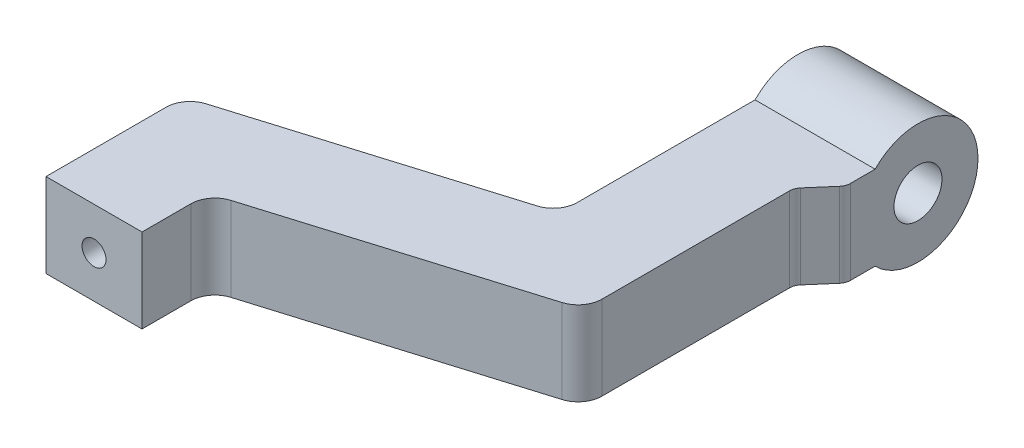
ISO-10303-21;
HEADER;
FILE_DESCRIPTION(('STEP AP214'),'2;1');
FILE_NAME('part.step','',(''),(''),'','','');
FILE_SCHEMA(('AUTOMOTIVE_DESIGN { 1 0 10303 214 1 1 1 1 }'));
ENDSEC;
DATA;
#1=APPLICATION_CONTEXT('core data for automotive mechanical design processes');
#2=APPLICATION_PROTOCOL_DEFINITION('international standard','automotive_design',2000,#1);
#3=PRODUCT_CONTEXT('',#1,'mechanical');
#4=PRODUCT('Part','Part','',(#3));
#5=PRODUCT_RELATED_PRODUCT_CATEGORY('part','',(#4));
#6=PRODUCT_DEFINITION_FORMATION('','',#4);
#7=PRODUCT_DEFINITION_CONTEXT('part definition',#1,'design');
#8=PRODUCT_DEFINITION('design','',#6,#7);
#9=PRODUCT_DEFINITION_SHAPE('','',#8);
#10=(LENGTH_UNIT() NAMED_UNIT(*) SI_UNIT(.MILLI.,.METRE.));
#11=(NAMED_UNIT(*) PLANE_ANGLE_UNIT() SI_UNIT($,.RADIAN.));
#12=(NAMED_UNIT(*) SI_UNIT($,.STERADIAN.) SOLID_ANGLE_UNIT());
#13=UNCERTAINTY_MEASURE_WITH_UNIT(LENGTH_MEASURE(1.E-05),#10,'distance_accuracy_value','');
#14=(GEOMETRIC_REPRESENTATION_CONTEXT(3) GLOBAL_UNCERTAINTY_ASSIGNED_CONTEXT((#13)) GLOBAL_UNIT_ASSIGNED_CONTEXT((#10,
#11,#12)) REPRESENTATION_CONTEXT('',''));
#15=CARTESIAN_POINT('',(0.,0.,0.));
#16=DIRECTION('',(0.,0.,1.));
#17=DIRECTION('',(1.,0.,0.));
#18=AXIS2_PLACEMENT_3D('',#15,#16,#17);
#19=CARTESIAN_POINT('',(9.49933731581298,3.5,-22.2534961346693));
#20=DIRECTION('',(0.,-1.,0.));
#21=DIRECTION('',(0.,0.,-1.));
#22=AXIS2_PLACEMENT_3D('',#19,#20,#21);
#23=CYLINDRICAL_SURFACE('',#22,0.999999999999999);
#24=CARTESIAN_POINT('',(9.49933731581298,0.,-22.2534961346693));
#25=DIRECTION('',(0.,1.,0.));
#26=DIRECTION('',(0.,0.,1.));
#27=AXIS2_PLACEMENT_3D('',#24,#25,#26);
#28=CIRCLE('',#27,0.999999999999999);
#29=CARTESIAN_POINT('',(9.78975935606598,0.,-21.2965974783136));
#30=VERTEX_POINT('',#29);
#31=CARTESIAN_POINT('',(10.499337315813,0.,-22.2534961346693));
#32=VERTEX_POINT('',#31);
#33=EDGE_CURVE('E157',#30,#32,#28,.T.);
#34=ORIENTED_EDGE('',*,*,#33,.F.);
#35=DIRECTION('',(0.,-1.,0.));
#36=VECTOR('',#35,1.);
#37=CARTESIAN_POINT('',(9.78975935606598,3.5,-21.2965974783136));
#38=LINE('',#37,#36);
#39=CARTESIAN_POINT('',(9.78975935606598,3.5,-21.2965974783136));
#40=VERTEX_POINT('',#39);
#41=EDGE_CURVE('E152',#40,#30,#38,.T.);
#42=ORIENTED_EDGE('',*,*,#41,.F.);
#43=CARTESIAN_POINT('',(9.49933731581298,3.5,-22.2534961346693));
#44=DIRECTION('',(0.,1.,0.));
#45=DIRECTION('',(0.,0.,1.));
#46=AXIS2_PLACEMENT_3D('',#43,#44,#45);
#47=CIRCLE('',#46,0.999999999999999);
#48=CARTESIAN_POINT('',(10.499337315813,3.5,-22.2534961346693));
#49=VERTEX_POINT('',#48);
#50=EDGE_CURVE('E154',#40,#49,#47,.T.);
#51=ORIENTED_EDGE('',*,*,#50,.T.);
#52=DIRECTION('',(0.,-1.,0.));
#53=VECTOR('',#52,1.);
#54=CARTESIAN_POINT('',(10.499337315813,3.5,-22.2534961346693));
#55=LINE('',#54,#53);
#56=EDGE_CURVE('E203',#49,#32,#55,.T.);
#57=ORIENTED_EDGE('',*,*,#56,.T.);
#58=EDGE_LOOP('',(#34,#42,#51,#57));
#59=FACE_BOUND('',#58,.T.);
#60=ADVANCED_FACE('F38',(#59),#23,.F.);
#61=CARTESIAN_POINT('',(-5.09270254841744,3.5,-16.7797189963762));
#62=DIRECTION('',(-0.290422040253007,0.,-0.956898656355667));
#63=DIRECTION('',(-0.956898656355667,0.,0.290422040253007));
#64=AXIS2_PLACEMENT_3D('',#61,#62,#63);
#65=PLANE('',#64);
#66=DIRECTION('',(0.956898656355667,0.,-0.290422040253007));
#67=VECTOR('',#66,1.);
#68=CARTESIAN_POINT('',(-5.09270254841744,0.,-16.7797189963762));
#69=LINE('',#68,#67);
#70=CARTESIAN_POINT('',(-0.79108472444003,0.,-18.085274831919));
#71=VERTEX_POINT('',#70);
#72=EDGE_CURVE('E205',#71,#30,#69,.T.);
#73=ORIENTED_EDGE('',*,*,#72,.F.);
#74=DIRECTION('',(0.,-1.,0.));
#75=VECTOR('',#74,1.);
#76=CARTESIAN_POINT('',(-0.79108472444003,3.5,-18.085274831919));
#77=LINE('',#76,#75);
#78=CARTESIAN_POINT('',(-0.79108472444003,3.5,-18.085274831919));
#79=VERTEX_POINT('',#78);
#80=EDGE_CURVE('E163',#79,#71,#77,.T.);
#81=ORIENTED_EDGE('',*,*,#80,.F.);
#82=DIRECTION('',(0.956898656355667,0.,-0.290422040253007));
#83=VECTOR('',#82,1.);
#84=CARTESIAN_POINT('',(-5.09270254841744,3.5,-16.7797189963762));
#85=LINE('',#84,#83);
#86=EDGE_CURVE('E168',#79,#40,#85,.T.);
#87=ORIENTED_EDGE('',*,*,#86,.T.);
#88=ORIENTED_EDGE('',*,*,#41,.T.);
#89=EDGE_LOOP('',(#73,#81,#87,#88));
#90=FACE_BOUND('',#89,.T.);
#91=ADVANCED_FACE('F174',(#90),#65,.T.);
#92=CARTESIAN_POINT('',(-0.500662684187023,3.5,-17.1283761755634));
#93=DIRECTION('',(0.,-1.,0.));
#94=DIRECTION('',(0.,0.,-1.));
#95=AXIS2_PLACEMENT_3D('',#92,#93,#94);
#96=CYLINDRICAL_SURFACE('',#95,0.999999999999999);
#97=CARTESIAN_POINT('',(-0.500662684187023,0.,-17.1283761755634));
#98=DIRECTION('',(0.,1.,0.));
#99=DIRECTION('',(0.,0.,1.));
#100=AXIS2_PLACEMENT_3D('',#97,#98,#99);
#101=CIRCLE('',#100,0.999999999999999);
#102=CARTESIAN_POINT('',(-1.50066268418702,0.,-17.1283761755634));
#103=VERTEX_POINT('',#102);
#104=EDGE_CURVE('E208',#103,#71,#101,.F.);
#105=ORIENTED_EDGE('',*,*,#104,.F.);
#106=DIRECTION('',(0.,-1.,0.));
#107=VECTOR('',#106,1.);
#108=CARTESIAN_POINT('',(-1.50066268418702,3.5,-17.1283761755634));
#109=LINE('',#108,#107);
#110=CARTESIAN_POINT('',(-1.50066268418702,3.5,-17.1283761755634));
#111=VERTEX_POINT('',#110);
#112=EDGE_CURVE('E252',#111,#103,#109,.T.);
#113=ORIENTED_EDGE('',*,*,#112,.F.);
#114=CARTESIAN_POINT('',(-0.500662684187023,3.5,-17.1283761755634));
#115=DIRECTION('',(0.,1.,0.));
#116=DIRECTION('',(0.,0.,1.));
#117=AXIS2_PLACEMENT_3D('',#114,#115,#116);
#118=CIRCLE('',#117,0.999999999999999);
#119=EDGE_CURVE('E175',#111,#79,#118,.F.);
#120=ORIENTED_EDGE('',*,*,#119,.T.);
#121=ORIENTED_EDGE('',*,*,#80,.T.);
#122=EDGE_LOOP('',(#105,#113,#120,#121));
#123=FACE_BOUND('',#122,.T.);
#124=ADVANCED_FACE('F336',(#123),#96,.T.);
#125=CARTESIAN_POINT('',(-1.50066268418702,3.5,0.));
#126=DIRECTION('',(-1.,0.,0.));
#127=DIRECTION('',(0.,0.,1.));
#128=AXIS2_PLACEMENT_3D('',#125,#126,#127);
#129=PLANE('',#128);
#130=DIRECTION('',(0.,0.,-1.));
#131=VECTOR('',#130,1.);
#132=CARTESIAN_POINT('',(-1.50066268418702,0.,0.));
#133=LINE('',#132,#131);
#134=CARTESIAN_POINT('',(-1.50066268418702,0.,-12.1283761755634));
#135=VERTEX_POINT('',#134);
#136=EDGE_CURVE('E211',#135,#103,#133,.T.);
#137=ORIENTED_EDGE('',*,*,#136,.F.);
#138=DIRECTION('',(0.,-1.,0.));
#139=VECTOR('',#138,1.);
#140=CARTESIAN_POINT('',(-1.50066268418702,3.5,-12.1283761755634));
#141=LINE('',#140,#139);
#142=CARTESIAN_POINT('',(-1.50066268418702,3.5,-12.1283761755634));
#143=VERTEX_POINT('',#142);
#144=EDGE_CURVE('E250',#143,#135,#141,.T.);
#145=ORIENTED_EDGE('',*,*,#144,.F.);
#146=DIRECTION('',(0.,0.,-1.));
#147=VECTOR('',#146,1.);
#148=CARTESIAN_POINT('',(-1.50066268418702,3.5,0.));
#149=LINE('',#148,#147);
#150=EDGE_CURVE('E177',#143,#111,#149,.T.);
#151=ORIENTED_EDGE('',*,*,#150,.T.);
#152=ORIENTED_EDGE('',*,*,#112,.T.);
#153=EDGE_LOOP('',(#137,#145,#151,#152));
#154=FACE_BOUND('',#153,.T.);
#155=ADVANCED_FACE('F365',(#154),#129,.T.);
#156=CARTESIAN_POINT('',(0.,3.5,-12.1283761755634));
#157=DIRECTION('',(0.,0.,-1.));
#158=DIRECTION('',(-1.,0.,0.));
#159=AXIS2_PLACEMENT_3D('',#156,#157,#158);
#160=PLANE('',#159);
#161=CARTESIAN_POINT('',(0.499337315812977,1.75,-12.1283761755634));
#162=DIRECTION('',(0.,0.,1.));
#163=DIRECTION('',(1.,0.,0.));
#164=AXIS2_PLACEMENT_3D('',#161,#162,#163);
#165=CIRCLE('',#164,0.5);
#166=CARTESIAN_POINT('',(0.999337315812977,1.75,-12.1283761755634));
#167=VERTEX_POINT('',#166);
#168=EDGE_CURVE('E302',#167,#167,#165,.T.);
#169=ORIENTED_EDGE('',*,*,#168,.F.);
#170=EDGE_LOOP('',(#169));
#171=FACE_BOUND('',#170,.T.);
#172=DIRECTION('',(1.,0.,0.));
#173=VECTOR('',#172,1.);
#174=CARTESIAN_POINT('',(0.,0.,-12.1283761755634));
#175=LINE('',#174,#173);
#176=CARTESIAN_POINT('',(2.49933731581298,0.,-12.1283761755634));
#177=VERTEX_POINT('',#176);
#178=EDGE_CURVE('E214',#135,#177,#175,.T.);
#179=ORIENTED_EDGE('',*,*,#178,.T.);
#180=DIRECTION('',(0.,-1.,0.));
#181=VECTOR('',#180,1.);
#182=CARTESIAN_POINT('',(2.49933731581298,3.5,-12.1283761755634));
#183=LINE('',#182,#181);
#184=CARTESIAN_POINT('',(2.49933731581298,3.5,-12.1283761755634));
#185=VERTEX_POINT('',#184);
#186=EDGE_CURVE('E247',#185,#177,#183,.T.);
#187=ORIENTED_EDGE('',*,*,#186,.F.);
#188=DIRECTION('',(1.,0.,0.));
#189=VECTOR('',#188,1.);
#190=CARTESIAN_POINT('',(0.,3.5,-12.1283761755634));
#191=LINE('',#190,#189);
#192=EDGE_CURVE('E183',#143,#185,#191,.T.);
#193=ORIENTED_EDGE('',*,*,#192,.F.);
#194=ORIENTED_EDGE('',*,*,#144,.T.);
#195=EDGE_LOOP('',(#179,#187,#193,#194));
#196=FACE_BOUND('',#195,.T.);
#197=ADVANCED_FACE('F361',(#171,#196),#160,.F.);
#198=CARTESIAN_POINT('',(2.49933731581298,3.5,0.));
#199=DIRECTION('',(-1.,0.,0.));
#200=DIRECTION('',(0.,0.,1.));
#201=AXIS2_PLACEMENT_3D('',#198,#199,#200);
#202=PLANE('',#201);
#203=DIRECTION('',(0.,0.,-1.));
#204=VECTOR('',#203,1.);
#205=CARTESIAN_POINT('',(2.49933731581298,0.,0.));
#206=LINE('',#205,#204);
#207=CARTESIAN_POINT('',(2.49933731581298,0.,-14.1622189758055));
#208=VERTEX_POINT('',#207);
#209=EDGE_CURVE('E216',#177,#208,#206,.T.);
#210=ORIENTED_EDGE('',*,*,#209,.T.);
#211=DIRECTION('',(0.,-1.,0.));
#212=VECTOR('',#211,1.);
#213=CARTESIAN_POINT('',(2.49933731581298,3.5,-14.1622189758055));
#214=LINE('',#213,#212);
#215=CARTESIAN_POINT('',(2.49933731581298,3.5,-14.1622189758055));
#216=VERTEX_POINT('',#215);
#217=EDGE_CURVE('E245',#216,#208,#214,.T.);
#218=ORIENTED_EDGE('',*,*,#217,.F.);
#219=DIRECTION('',(0.,0.,-1.));
#220=VECTOR('',#219,1.);
#221=CARTESIAN_POINT('',(2.49933731581298,3.5,0.));
#222=LINE('',#221,#220);
#223=EDGE_CURVE('E185',#185,#216,#222,.T.);
#224=ORIENTED_EDGE('',*,*,#223,.F.);
#225=ORIENTED_EDGE('',*,*,#186,.T.);
#226=EDGE_LOOP('',(#210,#218,#224,#225));
#227=FACE_BOUND('',#226,.T.);
#228=ADVANCED_FACE('F364',(#227),#202,.F.);
#229=CARTESIAN_POINT('',(3.49933731581298,3.5,-14.1622189758055));
#230=DIRECTION('',(0.,-1.,0.));
#231=DIRECTION('',(0.,0.,-1.));
#232=AXIS2_PLACEMENT_3D('',#229,#230,#231);
#233=CYLINDRICAL_SURFACE('',#232,0.999999999999999);
#234=CARTESIAN_POINT('',(3.49933731581298,0.,-14.1622189758055));
#235=DIRECTION('',(0.,1.,0.));
#236=DIRECTION('',(0.,0.,1.));
#237=AXIS2_PLACEMENT_3D('',#234,#235,#236);
#238=CIRCLE('',#237,0.999999999999999);
#239=CARTESIAN_POINT('',(3.20891527555997,0.,-15.1191176321612));
#240=VERTEX_POINT('',#239);
#241=EDGE_CURVE('E219',#240,#208,#238,.T.);
#242=ORIENTED_EDGE('',*,*,#241,.F.);
#243=DIRECTION('',(0.,-1.,0.));
#244=VECTOR('',#243,1.);
#245=CARTESIAN_POINT('',(3.20891527555997,3.5,-15.1191176321612));
#246=LINE('',#245,#244);
#247=CARTESIAN_POINT('',(3.20891527555997,3.5,-15.1191176321612));
#248=VERTEX_POINT('',#247);
#249=EDGE_CURVE('E243',#248,#240,#246,.T.);
#250=ORIENTED_EDGE('',*,*,#249,.F.);
#251=CARTESIAN_POINT('',(3.49933731581298,3.5,-14.1622189758055));
#252=DIRECTION('',(0.,1.,0.));
#253=DIRECTION('',(0.,0.,1.));
#254=AXIS2_PLACEMENT_3D('',#251,#252,#253);
#255=CIRCLE('',#254,0.999999999999999);
#256=EDGE_CURVE('E187',#248,#216,#255,.T.);
#257=ORIENTED_EDGE('',*,*,#256,.T.);
#258=ORIENTED_EDGE('',*,*,#217,.T.);
#259=EDGE_LOOP('',(#242,#250,#257,#258));
#260=FACE_BOUND('',#259,.T.);
#261=ADVANCED_FACE('F378',(#260),#233,.F.);
#262=CARTESIAN_POINT('',(-3.93101438740541,3.5,-12.9521243709536));
#263=DIRECTION('',(-0.290422040253007,0.,-0.956898656355667));
#264=DIRECTION('',(-0.956898656355667,0.,0.290422040253007));
#265=AXIS2_PLACEMENT_3D('',#262,#263,#264);
#266=PLANE('',#265);
#267=DIRECTION('',(0.956898656355667,0.,-0.290422040253007));
#268=VECTOR('',#267,1.);
#269=CARTESIAN_POINT('',(-3.93101438740541,0.,-12.9521243709536));
#270=LINE('',#269,#268);
#271=CARTESIAN_POINT('',(13.789759356066,0.,-18.3304402785558));
#272=VERTEX_POINT('',#271);
#273=EDGE_CURVE('E222',#240,#272,#270,.T.);
#274=ORIENTED_EDGE('',*,*,#273,.T.);
#275=DIRECTION('',(0.,-1.,0.));
#276=VECTOR('',#275,1.);
#277=CARTESIAN_POINT('',(13.789759356066,3.5,-18.3304402785558));
#278=LINE('',#277,#276);
#279=CARTESIAN_POINT('',(13.789759356066,3.5,-18.3304402785558));
#280=VERTEX_POINT('',#279);
#281=EDGE_CURVE('E240',#280,#272,#278,.T.);
#282=ORIENTED_EDGE('',*,*,#281,.F.);
#283=DIRECTION('',(0.956898656355667,0.,-0.290422040253007));
#284=VECTOR('',#283,1.);
#285=CARTESIAN_POINT('',(-3.93101438740541,3.5,-12.9521243709536));
#286=LINE('',#285,#284);
#287=EDGE_CURVE('E190',#248,#280,#286,.T.);
#288=ORIENTED_EDGE('',*,*,#287,.F.);
#289=ORIENTED_EDGE('',*,*,#249,.T.);
#290=EDGE_LOOP('',(#274,#282,#288,#289));
#291=FACE_BOUND('',#290,.T.);
#292=ADVANCED_FACE('F396',(#291),#266,.F.);
#293=CARTESIAN_POINT('',(13.499337315813,3.5,-19.2873389349115));
#294=DIRECTION('',(0.,-1.,0.));
#295=DIRECTION('',(0.,0.,-1.));
#296=AXIS2_PLACEMENT_3D('',#293,#294,#295);
#297=CYLINDRICAL_SURFACE('',#296,1.);
#298=CARTESIAN_POINT('',(13.499337315813,0.,-19.2873389349115));
#299=DIRECTION('',(0.,1.,0.));
#300=DIRECTION('',(0.,0.,1.));
#301=AXIS2_PLACEMENT_3D('',#298,#299,#300);
#302=CIRCLE('',#301,1.);
#303=CARTESIAN_POINT('',(14.499337315813,0.,-19.2873389349115));
#304=VERTEX_POINT('',#303);
#305=EDGE_CURVE('E224',#272,#304,#302,.T.);
#306=ORIENTED_EDGE('',*,*,#305,.T.);
#307=DIRECTION('',(0.,-1.,0.));
#308=VECTOR('',#307,1.);
#309=CARTESIAN_POINT('',(14.499337315813,3.5,-19.2873389349115));
#310=LINE('',#309,#308);
#311=CARTESIAN_POINT('',(14.499337315813,3.5,-19.2873389349115));
#312=VERTEX_POINT('',#311);
#313=EDGE_CURVE('E237',#312,#304,#310,.T.);
#314=ORIENTED_EDGE('',*,*,#313,.F.);
#315=CARTESIAN_POINT('',(13.499337315813,3.5,-19.2873389349115));
#316=DIRECTION('',(0.,1.,0.));
#317=DIRECTION('',(0.,0.,1.));
#318=AXIS2_PLACEMENT_3D('',#315,#316,#317);
#319=CIRCLE('',#318,1.);
#320=EDGE_CURVE('E192',#280,#312,#319,.T.);
#321=ORIENTED_EDGE('',*,*,#320,.F.);
#322=ORIENTED_EDGE('',*,*,#281,.T.);
#323=EDGE_LOOP('',(#306,#314,#321,#322));
#324=FACE_BOUND('',#323,.T.);
#325=ADVANCED_FACE('F399',(#324),#297,.T.);
#326=CARTESIAN_POINT('',(14.499337315813,3.5,0.));
#327=DIRECTION('',(-1.,0.,0.));
#328=DIRECTION('',(0.,0.,1.));
#329=AXIS2_PLACEMENT_3D('',#326,#327,#328);
#330=PLANE('',#329);
#331=DIRECTION('',(0.,0.,-1.));
#332=VECTOR('',#331,1.);
#333=CARTESIAN_POINT('',(14.499337315813,0.,0.));
#334=LINE('',#333,#332);
#335=CARTESIAN_POINT('',(14.499337315813,0.,-27.1012312673421));
#336=VERTEX_POINT('',#335);
#337=EDGE_CURVE('E226',#304,#336,#334,.T.);
#338=ORIENTED_EDGE('',*,*,#337,.T.);
#339=DIRECTION('',(0.,-1.,0.));
#340=VECTOR('',#339,1.);
#341=CARTESIAN_POINT('',(14.499337315813,3.5,-27.1012312673421));
#342=LINE('',#341,#340);
#343=CARTESIAN_POINT('',(14.499337315813,3.5,-27.1012312673421));
#344=VERTEX_POINT('',#343);
#345=EDGE_CURVE('E261',#336,#344,#342,.F.);
#346=ORIENTED_EDGE('',*,*,#345,.T.);
#347=DIRECTION('',(0.,0.,-1.));
#348=VECTOR('',#347,1.);
#349=CARTESIAN_POINT('',(14.499337315813,3.5,0.));
#350=LINE('',#349,#348);
#351=EDGE_CURVE('E194',#312,#344,#350,.T.);
#352=ORIENTED_EDGE('',*,*,#351,.F.);
#353=ORIENTED_EDGE('',*,*,#313,.T.);
#354=EDGE_LOOP('',(#338,#346,#352,#353));
#355=FACE_BOUND('',#354,.T.);
#356=ADVANCED_FACE('F275',(#355),#330,.F.);
#357=CARTESIAN_POINT('',(-5.19883660845573,3.5,-4.49259691720418));
#358=DIRECTION('',(0.756629125275996,0.,0.65384429857886));
#359=DIRECTION('',(0.65384429857886,0.,-0.756629125275996));
#360=AXIS2_PLACEMENT_3D('',#357,#358,#359);
#361=PLANE('',#360);
#362=DIRECTION('',(-0.65384429857886,0.,0.756629125275996));
#363=VECTOR('',#362,1.);
#364=CARTESIAN_POINT('',(-5.19883660845573,3.5,-4.49259691720418));
#365=LINE('',#364,#363);
#366=CARTESIAN_POINT('',(15.377651878451,3.5,-28.3037252224273));
#367=VERTEX_POINT('',#366);
#368=CARTESIAN_POINT('',(14.621022753175,3.5,-27.4281534166316));
#369=VERTEX_POINT('',#368);
#370=EDGE_CURVE('E197',#367,#369,#365,.T.);
#371=ORIENTED_EDGE('',*,*,#370,.T.);
#372=DIRECTION('',(0.,-1.,0.));
#373=VECTOR('',#372,1.);
#374=CARTESIAN_POINT('',(14.621022753175,3.5,-27.4281534166316));
#375=LINE('',#374,#373);
#376=CARTESIAN_POINT('',(14.621022753175,0.,-27.4281534166316));
#377=VERTEX_POINT('',#376);
#378=EDGE_CURVE('E258',#369,#377,#375,.T.);
#379=ORIENTED_EDGE('',*,*,#378,.T.);
#380=DIRECTION('',(-0.65384429857886,0.,0.756629125275996));
#381=VECTOR('',#380,1.);
#382=CARTESIAN_POINT('',(-5.19883660845573,0.,-4.49259691720418));
#383=LINE('',#382,#381);
#384=CARTESIAN_POINT('',(15.377651878451,0.,-28.3037252224273));
#385=VERTEX_POINT('',#384);
#386=EDGE_CURVE('E229',#385,#377,#383,.T.);
#387=ORIENTED_EDGE('',*,*,#386,.F.);
#388=DIRECTION('',(0.,-1.,0.));
#389=VECTOR('',#388,1.);
#390=CARTESIAN_POINT('',(15.377651878451,3.5,-28.3037252224273));
#391=LINE('',#390,#389);
#392=EDGE_CURVE('E256',#385,#367,#391,.F.);
#393=ORIENTED_EDGE('',*,*,#392,.T.);
#394=EDGE_LOOP('',(#371,#379,#387,#393));
#395=FACE_BOUND('',#394,.T.);
#396=ADVANCED_FACE('F281',(#395),#361,.T.);
#397=CARTESIAN_POINT('',(15.499337315813,3.5,0.));
#398=DIRECTION('',(1.,0.,0.));
#399=DIRECTION('',(0.,0.,-1.));
#400=AXIS2_PLACEMENT_3D('',#397,#398,#399);
#401=PLANE('',#400);
#402=CARTESIAN_POINT('',(15.499337315813,1.75,-31.4445397041474));
#403=DIRECTION('',(-1.,0.,0.));
#404=DIRECTION('',(0.,0.,1.));
#405=AXIS2_PLACEMENT_3D('',#402,#403,#404);
#406=CIRCLE('',#405,1.);
#407=CARTESIAN_POINT('',(15.499337315813,1.75,-30.4445397041474));
#408=VERTEX_POINT('',#407);
#409=EDGE_CURVE('E306',#408,#408,#406,.T.);
#410=ORIENTED_EDGE('',*,*,#409,.T.);
#411=EDGE_LOOP('',(#410));
#412=FACE_BOUND('',#411,.T.);
#413=DIRECTION('',(0.,0.,1.));
#414=VECTOR('',#413,1.);
#415=CARTESIAN_POINT('',(15.499337315813,3.5,0.));
#416=LINE('',#415,#414);
#417=CARTESIAN_POINT('',(15.499337315813,3.5,-29.6591825970117));
#418=VERTEX_POINT('',#417);
#419=CARTESIAN_POINT('',(15.499337315813,3.5,-28.6306473717167));
#420=VERTEX_POINT('',#419);
#421=EDGE_CURVE('E200',#418,#420,#416,.T.);
#422=ORIENTED_EDGE('',*,*,#421,.T.);
#423=DIRECTION('',(0.,-1.,0.));
#424=VECTOR('',#423,1.);
#425=CARTESIAN_POINT('',(15.499337315813,3.5,-28.6306473717167));
#426=LINE('',#425,#424);
#427=CARTESIAN_POINT('',(15.499337315813,0.,-28.6306473717167));
#428=VERTEX_POINT('',#427);
#429=EDGE_CURVE('E263',#420,#428,#426,.T.);
#430=ORIENTED_EDGE('',*,*,#429,.T.);
#431=DIRECTION('',(0.,0.,1.));
#432=VECTOR('',#431,1.);
#433=CARTESIAN_POINT('',(15.499337315813,0.,0.));
#434=LINE('',#433,#432);
#435=CARTESIAN_POINT('',(15.499337315813,0.,-29.6591825970117));
#436=VERTEX_POINT('',#435);
#437=EDGE_CURVE('E232',#436,#428,#434,.T.);
#438=ORIENTED_EDGE('',*,*,#437,.F.);
#439=CARTESIAN_POINT('',(15.499337315813,1.75,-31.4445397041474));
#440=DIRECTION('',(-1.,0.,0.));
#441=DIRECTION('',(0.,0.,1.));
#442=AXIS2_PLACEMENT_3D('',#439,#440,#441);
#443=CIRCLE('',#442,2.5);
#444=EDGE_CURVE('E295',#418,#436,#443,.T.);
#445=ORIENTED_EDGE('',*,*,#444,.F.);
#446=EDGE_LOOP('',(#422,#430,#438,#445));
#447=FACE_BOUND('',#446,.T.);
#448=ADVANCED_FACE('F284',(#412,#447),#401,.T.);
#449=CARTESIAN_POINT('',(10.499337315813,3.5,0.));
#450=DIRECTION('',(-1.,0.,0.));
#451=DIRECTION('',(0.,0.,1.));
#452=AXIS2_PLACEMENT_3D('',#449,#450,#451);
#453=PLANE('',#452);
#454=CARTESIAN_POINT('',(10.499337315813,1.75,-31.4445397041474));
#455=DIRECTION('',(-1.,0.,0.));
#456=DIRECTION('',(0.,0.,1.));
#457=AXIS2_PLACEMENT_3D('',#454,#455,#456);
#458=CIRCLE('',#457,1.);
#459=CARTESIAN_POINT('',(10.499337315813,1.75,-30.4445397041474));
#460=VERTEX_POINT('',#459);
#461=EDGE_CURVE('E308',#460,#460,#458,.T.);
#462=ORIENTED_EDGE('',*,*,#461,.F.);
#463=EDGE_LOOP('',(#462));
#464=FACE_BOUND('',#463,.T.);
#465=DIRECTION('',(0.,0.,-1.));
#466=VECTOR('',#465,1.);
#467=CARTESIAN_POINT('',(10.499337315813,3.5,0.));
#468=LINE('',#467,#466);
#469=CARTESIAN_POINT('',(10.499337315813,3.5,-29.6591825970117));
#470=VERTEX_POINT('',#469);
#471=EDGE_CURVE('E171',#49,#470,#468,.T.);
#472=ORIENTED_EDGE('',*,*,#471,.T.);
#473=CARTESIAN_POINT('',(10.499337315813,1.75,-31.4445397041474));
#474=DIRECTION('',(-1.,0.,0.));
#475=DIRECTION('',(0.,0.,1.));
#476=AXIS2_PLACEMENT_3D('',#473,#474,#475);
#477=CIRCLE('',#476,2.5);
#478=CARTESIAN_POINT('',(10.499337315813,0.,-29.6591825970117));
#479=VERTEX_POINT('',#478);
#480=EDGE_CURVE('E294',#470,#479,#477,.T.);
#481=ORIENTED_EDGE('',*,*,#480,.T.);
#482=DIRECTION('',(0.,0.,-1.));
#483=VECTOR('',#482,1.);
#484=CARTESIAN_POINT('',(10.499337315813,0.,0.));
#485=LINE('',#484,#483);
#486=EDGE_CURVE('E172',#32,#479,#485,.T.);
#487=ORIENTED_EDGE('',*,*,#486,.F.);
#488=ORIENTED_EDGE('',*,*,#56,.F.);
#489=EDGE_LOOP('',(#472,#481,#487,#488));
#490=FACE_BOUND('',#489,.T.);
#491=ADVANCED_FACE('F297',(#464,#490),#453,.T.);
#492=CARTESIAN_POINT('',(0.,3.5,0.));
#493=DIRECTION('',(0.,1.,0.));
#494=DIRECTION('',(0.,0.,1.));
#495=AXIS2_PLACEMENT_3D('',#492,#493,#494);
#496=PLANE('',#495);
#497=ORIENTED_EDGE('',*,*,#370,.F.);
#498=CARTESIAN_POINT('',(14.999337315813,3.5,-28.6306473717167));
#499=DIRECTION('',(0.,1.,0.));
#500=DIRECTION('',(0.,0.,1.));
#501=AXIS2_PLACEMENT_3D('',#498,#499,#500);
#502=CIRCLE('',#501,0.5);
#503=EDGE_CURVE('E53',#367,#420,#502,.T.);
#504=ORIENTED_EDGE('',*,*,#503,.T.);
#505=ORIENTED_EDGE('',*,*,#421,.F.);
#506=DIRECTION('',(-1.,0.,0.));
#507=VECTOR('',#506,1.);
#508=CARTESIAN_POINT('',(15.499337315813,3.5,-29.6591825970117));
#509=LINE('',#508,#507);
#510=EDGE_CURVE('E206',#470,#418,#509,.F.);
#511=ORIENTED_EDGE('',*,*,#510,.F.);
#512=ORIENTED_EDGE('',*,*,#471,.F.);
#513=ORIENTED_EDGE('',*,*,#50,.F.);
#514=ORIENTED_EDGE('',*,*,#86,.F.);
#515=ORIENTED_EDGE('',*,*,#119,.F.);
#516=ORIENTED_EDGE('',*,*,#150,.F.);
#517=ORIENTED_EDGE('',*,*,#192,.T.);
#518=ORIENTED_EDGE('',*,*,#223,.T.);
#519=ORIENTED_EDGE('',*,*,#256,.F.);
#520=ORIENTED_EDGE('',*,*,#287,.T.);
#521=ORIENTED_EDGE('',*,*,#320,.T.);
#522=ORIENTED_EDGE('',*,*,#351,.T.);
#523=CARTESIAN_POINT('',(14.999337315813,3.5,-27.1012312673421));
#524=DIRECTION('',(0.,1.,0.));
#525=DIRECTION('',(0.,0.,1.));
#526=AXIS2_PLACEMENT_3D('',#523,#524,#525);
#527=CIRCLE('',#526,0.5);
#528=EDGE_CURVE('E11',#344,#369,#527,.F.);
#529=ORIENTED_EDGE('',*,*,#528,.T.);
#530=EDGE_LOOP('',(#497,#504,#505,#511,#512,#513,#514,#515,#516,#517,#518,#519,#520,#521,#522,#529));
#531=FACE_BOUND('',#530,.T.);
#532=ADVANCED_FACE('F166',(#531),#496,.T.);
#533=CARTESIAN_POINT('',(0.,0.,0.));
#534=DIRECTION('',(0.,1.,0.));
#535=DIRECTION('',(0.,0.,1.));
#536=AXIS2_PLACEMENT_3D('',#533,#534,#535);
#537=PLANE('',#536);
#538=ORIENTED_EDGE('',*,*,#437,.T.);
#539=CARTESIAN_POINT('',(14.999337315813,0.,-28.6306473717167));
#540=DIRECTION('',(0.,1.,0.));
#541=DIRECTION('',(0.,0.,1.));
#542=AXIS2_PLACEMENT_3D('',#539,#540,#541);
#543=CIRCLE('',#542,0.5);
#544=EDGE_CURVE('E61',#428,#385,#543,.F.);
#545=ORIENTED_EDGE('',*,*,#544,.T.);
#546=ORIENTED_EDGE('',*,*,#386,.T.);
#547=CARTESIAN_POINT('',(14.999337315813,0.,-27.1012312673421));
#548=DIRECTION('',(0.,1.,0.));
#549=DIRECTION('',(0.,0.,1.));
#550=AXIS2_PLACEMENT_3D('',#547,#548,#549);
#551=CIRCLE('',#550,0.5);
#552=EDGE_CURVE('E46',#377,#336,#551,.T.);
#553=ORIENTED_EDGE('',*,*,#552,.T.);
#554=ORIENTED_EDGE('',*,*,#337,.F.);
#555=ORIENTED_EDGE('',*,*,#305,.F.);
#556=ORIENTED_EDGE('',*,*,#273,.F.);
#557=ORIENTED_EDGE('',*,*,#241,.T.);
#558=ORIENTED_EDGE('',*,*,#209,.F.);
#559=ORIENTED_EDGE('',*,*,#178,.F.);
#560=ORIENTED_EDGE('',*,*,#136,.T.);
#561=ORIENTED_EDGE('',*,*,#104,.T.);
#562=ORIENTED_EDGE('',*,*,#72,.T.);
#563=ORIENTED_EDGE('',*,*,#33,.T.);
#564=ORIENTED_EDGE('',*,*,#486,.T.);
#565=DIRECTION('',(-1.,0.,0.));
#566=VECTOR('',#565,1.);
#567=CARTESIAN_POINT('',(15.499337315813,0.,-29.6591825970117));
#568=LINE('',#567,#566);
#569=EDGE_CURVE('E162',#479,#436,#568,.F.);
#570=ORIENTED_EDGE('',*,*,#569,.T.);
#571=EDGE_LOOP('',(#538,#545,#546,#553,#554,#555,#556,#557,#558,#559,#560,#561,#562,#563,#564,#570));
#572=FACE_BOUND('',#571,.T.);
#573=ADVANCED_FACE('F268',(#572),#537,.F.);
#574=CARTESIAN_POINT('',(15.499337315813,1.75,-31.4445397041474));
#575=DIRECTION('',(-1.,0.,0.));
#576=DIRECTION('',(0.,0.,1.));
#577=AXIS2_PLACEMENT_3D('',#574,#575,#576);
#578=CYLINDRICAL_SURFACE('',#577,2.5);
#579=ORIENTED_EDGE('',*,*,#480,.F.);
#580=ORIENTED_EDGE('',*,*,#510,.T.);
#581=ORIENTED_EDGE('',*,*,#444,.T.);
#582=ORIENTED_EDGE('',*,*,#569,.F.);
#583=EDGE_LOOP('',(#579,#580,#581,#582));
#584=FACE_BOUND('',#583,.T.);
#585=ADVANCED_FACE('F292',(#584),#578,.T.);
#586=CARTESIAN_POINT('',(14.999337315813,3.5,-27.1012312673421));
#587=DIRECTION('',(0.,-1.,0.));
#588=DIRECTION('',(0.,0.,-1.));
#589=AXIS2_PLACEMENT_3D('',#586,#587,#588);
#590=CYLINDRICAL_SURFACE('',#589,0.5);
#591=ORIENTED_EDGE('',*,*,#528,.F.);
#592=ORIENTED_EDGE('',*,*,#345,.F.);
#593=ORIENTED_EDGE('',*,*,#552,.F.);
#594=ORIENTED_EDGE('',*,*,#378,.F.);
#595=EDGE_LOOP('',(#591,#592,#593,#594));
#596=FACE_BOUND('',#595,.T.);
#597=ADVANCED_FACE('F279',(#596),#590,.F.);
#598=CARTESIAN_POINT('',(14.999337315813,3.5,-28.6306473717167));
#599=DIRECTION('',(0.,-1.,0.));
#600=DIRECTION('',(0.,0.,-1.));
#601=AXIS2_PLACEMENT_3D('',#598,#599,#600);
#602=CYLINDRICAL_SURFACE('',#601,0.5);
#603=ORIENTED_EDGE('',*,*,#503,.F.);
#604=ORIENTED_EDGE('',*,*,#392,.F.);
#605=ORIENTED_EDGE('',*,*,#544,.F.);
#606=ORIENTED_EDGE('',*,*,#429,.F.);
#607=EDGE_LOOP('',(#603,#604,#605,#606));
#608=FACE_BOUND('',#607,.T.);
#609=ADVANCED_FACE('F40',(#608),#602,.T.);
#610=CARTESIAN_POINT('',(0.499337315812977,1.75,-13.1283761755634));
#611=DIRECTION('',(0.,0.,1.));
#612=DIRECTION('',(1.,0.,0.));
#613=AXIS2_PLACEMENT_3D('',#610,#611,#612);
#614=CYLINDRICAL_SURFACE('',#613,0.5);
#615=CARTESIAN_POINT('',(0.499337315812977,1.75,-13.1283761755634));
#616=DIRECTION('',(0.,0.,1.));
#617=DIRECTION('',(1.,0.,0.));
#618=AXIS2_PLACEMENT_3D('',#615,#616,#617);
#619=CIRCLE('',#618,0.5);
#620=CARTESIAN_POINT('',(0.999337315812977,1.75,-13.1283761755634));
#621=VERTEX_POINT('',#620);
#622=EDGE_CURVE('E298',#621,#621,#619,.T.);
#623=ORIENTED_EDGE('',*,*,#622,.F.);
#624=EDGE_LOOP('',(#623));
#625=FACE_BOUND('',#624,.T.);
#626=ORIENTED_EDGE('',*,*,#168,.T.);
#627=EDGE_LOOP('',(#626));
#628=FACE_BOUND('',#627,.T.);
#629=ADVANCED_FACE('F344',(#625,#628),#614,.F.);
#630=CARTESIAN_POINT('',(0.499337315812977,1.75,-13.1283761755634));
#631=DIRECTION('',(0.,0.,1.));
#632=DIRECTION('',(1.,0.,0.));
#633=AXIS2_PLACEMENT_3D('',#630,#631,#632);
#634=PLANE('',#633);
#635=ORIENTED_EDGE('',*,*,#622,.T.);
#636=EDGE_LOOP('',(#635));
#637=FACE_BOUND('',#636,.T.);
#638=ADVANCED_FACE('F318',(#637),#634,.T.);
#639=CARTESIAN_POINT('',(15.499337315813,1.75,-31.4445397041474));
#640=DIRECTION('',(-1.,0.,0.));
#641=DIRECTION('',(0.,0.,1.));
#642=AXIS2_PLACEMENT_3D('',#639,#640,#641);
#643=CYLINDRICAL_SURFACE('',#642,1.);
#644=ORIENTED_EDGE('',*,*,#409,.F.);
#645=EDGE_LOOP('',(#644));
#646=FACE_BOUND('',#645,.T.);
#647=ORIENTED_EDGE('',*,*,#461,.T.);
#648=EDGE_LOOP('',(#647));
#649=FACE_BOUND('',#648,.T.);
#650=ADVANCED_FACE('F315',(#646,#649),#643,.F.);
#651=CLOSED_SHELL('',(#60,#91,#124,#155,#197,#228,#261,#292,#325,#356,#396,#448,#491,#532,#573,
#585,#597,#609,#629,#638,#650));
#652=MANIFOLD_SOLID_BREP('B2',#651);
#653=ADVANCED_BREP_SHAPE_REPRESENTATION('',(#18,#652),#14);
#654=SHAPE_DEFINITION_REPRESENTATION(#9,#653);
ENDSEC;
END-ISO-10303-21;
